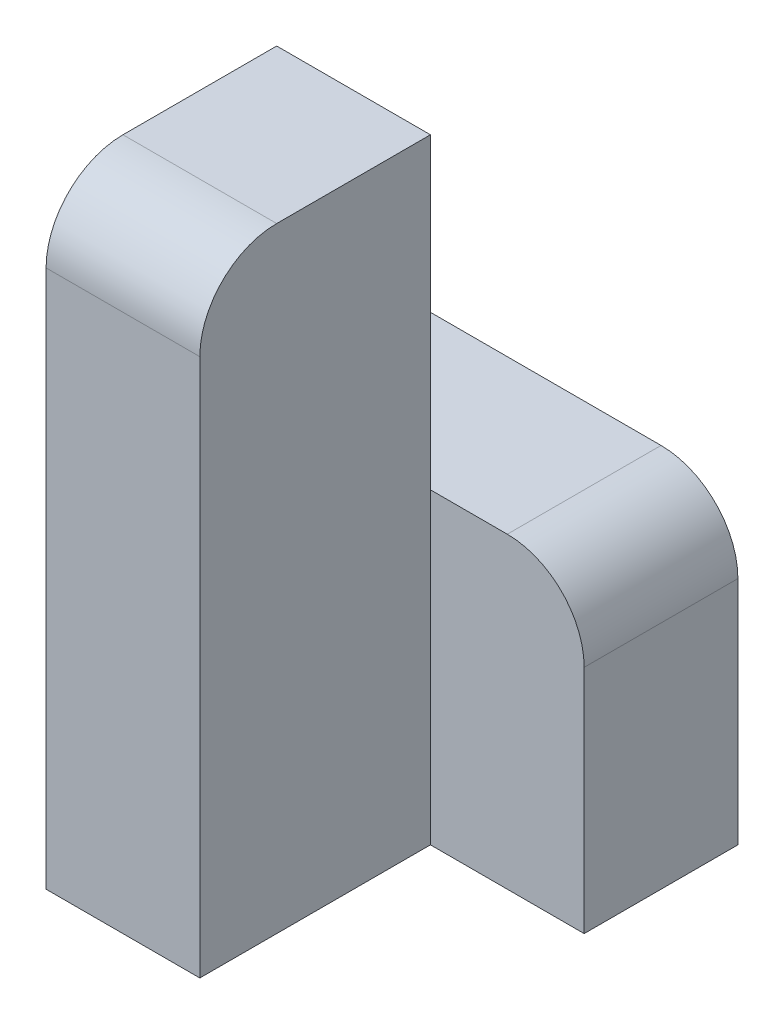
ISO-10303-21;
HEADER;
FILE_DESCRIPTION(('STEP AP214'),'2;1');
FILE_NAME('part.step','',(''),(''),'','','');
FILE_SCHEMA(('AUTOMOTIVE_DESIGN { 1 0 10303 214 1 1 1 1 }'));
ENDSEC;
DATA;
#1=APPLICATION_CONTEXT('core data for automotive mechanical design processes');
#2=APPLICATION_PROTOCOL_DEFINITION('international standard','automotive_design',2000,#1);
#3=PRODUCT_CONTEXT('',#1,'mechanical');
#4=PRODUCT('Part','Part','',(#3));
#5=PRODUCT_RELATED_PRODUCT_CATEGORY('part','',(#4));
#6=PRODUCT_DEFINITION_FORMATION('','',#4);
#7=PRODUCT_DEFINITION_CONTEXT('part definition',#1,'design');
#8=PRODUCT_DEFINITION('design','',#6,#7);
#9=PRODUCT_DEFINITION_SHAPE('','',#8);
#10=(LENGTH_UNIT() NAMED_UNIT(*) SI_UNIT(.MILLI.,.METRE.));
#11=(NAMED_UNIT(*) PLANE_ANGLE_UNIT() SI_UNIT($,.RADIAN.));
#12=(NAMED_UNIT(*) SI_UNIT($,.STERADIAN.) SOLID_ANGLE_UNIT());
#13=UNCERTAINTY_MEASURE_WITH_UNIT(LENGTH_MEASURE(1.E-05),#10,'distance_accuracy_value','');
#14=(GEOMETRIC_REPRESENTATION_CONTEXT(3) GLOBAL_UNCERTAINTY_ASSIGNED_CONTEXT((#13)) GLOBAL_UNIT_ASSIGNED_CONTEXT((#10,
#11,#12)) REPRESENTATION_CONTEXT('',''));
#15=CARTESIAN_POINT('',(0.,0.,0.));
#16=DIRECTION('',(0.,0.,1.));
#17=DIRECTION('',(1.,0.,0.));
#18=AXIS2_PLACEMENT_3D('',#15,#16,#17);
#19=CARTESIAN_POINT('',(-10.,0.,30.));
#20=DIRECTION('',(0.,-1.,0.));
#21=DIRECTION('',(1.,0.,0.));
#22=AXIS2_PLACEMENT_3D('',#19,#20,#21);
#23=PLANE('',#22);
#24=DIRECTION('',(0.,0.,-1.));
#25=VECTOR('',#24,1.);
#26=CARTESIAN_POINT('',(-30.,0.,30.));
#27=LINE('',#26,#25);
#28=CARTESIAN_POINT('',(-30.,0.,20.));
#29=VERTEX_POINT('',#28);
#30=CARTESIAN_POINT('',(-30.,0.,0.));
#31=VERTEX_POINT('',#30);
#32=EDGE_CURVE('E171',#29,#31,#27,.T.);
#33=ORIENTED_EDGE('',*,*,#32,.F.);
#34=DIRECTION('',(-1.,0.,0.));
#35=VECTOR('',#34,1.);
#36=CARTESIAN_POINT('',(-10.,0.,20.));
#37=LINE('',#36,#35);
#38=CARTESIAN_POINT('',(-10.,0.,20.));
#39=VERTEX_POINT('',#38);
#40=EDGE_CURVE('E43',#29,#39,#37,.F.);
#41=ORIENTED_EDGE('',*,*,#40,.T.);
#42=DIRECTION('',(0.,0.,-1.));
#43=VECTOR('',#42,1.);
#44=CARTESIAN_POINT('',(-10.,0.,30.));
#45=LINE('',#44,#43);
#46=CARTESIAN_POINT('',(-10.,0.,0.));
#47=VERTEX_POINT('',#46);
#48=EDGE_CURVE('E158',#39,#47,#45,.T.);
#49=ORIENTED_EDGE('',*,*,#48,.T.);
#50=DIRECTION('',(-1.,0.,0.));
#51=VECTOR('',#50,1.);
#52=CARTESIAN_POINT('',(-10.,0.,0.));
#53=LINE('',#52,#51);
#54=EDGE_CURVE('E148',#47,#31,#53,.T.);
#55=ORIENTED_EDGE('',*,*,#54,.T.);
#56=EDGE_LOOP('',(#33,#41,#49,#55));
#57=FACE_BOUND('',#56,.T.);
#58=ADVANCED_FACE('F35',(#57),#23,.F.);
#59=CARTESIAN_POINT('',(-30.,0.,30.));
#60=DIRECTION('',(1.,0.,0.));
#61=DIRECTION('',(0.,0.,-1.));
#62=AXIS2_PLACEMENT_3D('',#59,#60,#61);
#63=PLANE('',#62);
#64=DIRECTION('',(0.,-1.,0.));
#65=VECTOR('',#64,1.);
#66=CARTESIAN_POINT('',(-30.,0.,30.));
#67=LINE('',#66,#65);
#68=CARTESIAN_POINT('',(-30.,-10.,30.));
#69=VERTEX_POINT('',#68);
#70=CARTESIAN_POINT('',(-30.,-80.,30.));
#71=VERTEX_POINT('',#70);
#72=EDGE_CURVE('E150',#69,#71,#67,.T.);
#73=ORIENTED_EDGE('',*,*,#72,.F.);
#74=CARTESIAN_POINT('',(-30.,-10.,20.));
#75=DIRECTION('',(1.,0.,0.));
#76=DIRECTION('',(0.,0.,-1.));
#77=AXIS2_PLACEMENT_3D('',#74,#75,#76);
#78=CIRCLE('',#77,10.);
#79=EDGE_CURVE('E57',#69,#29,#78,.F.);
#80=ORIENTED_EDGE('',*,*,#79,.T.);
#81=ORIENTED_EDGE('',*,*,#32,.T.);
#82=DIRECTION('',(0.,-1.,0.));
#83=VECTOR('',#82,1.);
#84=CARTESIAN_POINT('',(-30.,0.,0.));
#85=LINE('',#84,#83);
#86=CARTESIAN_POINT('',(-30.,-40.,0.));
#87=VERTEX_POINT('',#86);
#88=EDGE_CURVE('E126',#31,#87,#85,.T.);
#89=ORIENTED_EDGE('',*,*,#88,.T.);
#90=DIRECTION('',(0.,0.,1.));
#91=VECTOR('',#90,1.);
#92=CARTESIAN_POINT('',(-30.,-40.,-20.));
#93=LINE('',#92,#91);
#94=CARTESIAN_POINT('',(-30.,-40.,-20.));
#95=VERTEX_POINT('',#94);
#96=EDGE_CURVE('E111',#95,#87,#93,.T.);
#97=ORIENTED_EDGE('',*,*,#96,.F.);
#98=DIRECTION('',(0.,-1.,0.));
#99=VECTOR('',#98,1.);
#100=CARTESIAN_POINT('',(-30.,-40.,-20.));
#101=LINE('',#100,#99);
#102=CARTESIAN_POINT('',(-30.,-80.,-20.));
#103=VERTEX_POINT('',#102);
#104=EDGE_CURVE('E118',#95,#103,#101,.T.);
#105=ORIENTED_EDGE('',*,*,#104,.T.);
#106=DIRECTION('',(0.,0.,-1.));
#107=VECTOR('',#106,1.);
#108=CARTESIAN_POINT('',(-30.,-80.,30.));
#109=LINE('',#108,#107);
#110=EDGE_CURVE('E169',#71,#103,#109,.T.);
#111=ORIENTED_EDGE('',*,*,#110,.F.);
#112=EDGE_LOOP('',(#73,#80,#81,#89,#97,#105,#111));
#113=FACE_BOUND('',#112,.T.);
#114=ADVANCED_FACE('F123',(#113),#63,.F.);
#115=CARTESIAN_POINT('',(-30.,-80.,30.));
#116=DIRECTION('',(0.,1.,0.));
#117=DIRECTION('',(0.,0.,1.));
#118=AXIS2_PLACEMENT_3D('',#115,#116,#117);
#119=PLANE('',#118);
#120=ORIENTED_EDGE('',*,*,#110,.T.);
#121=DIRECTION('',(1.,0.,0.));
#122=VECTOR('',#121,1.);
#123=CARTESIAN_POINT('',(-30.,-80.,-20.));
#124=LINE('',#123,#122);
#125=CARTESIAN_POINT('',(10.,-80.,-20.));
#126=VERTEX_POINT('',#125);
#127=EDGE_CURVE('E134',#103,#126,#124,.T.);
#128=ORIENTED_EDGE('',*,*,#127,.T.);
#129=DIRECTION('',(0.,0.,1.));
#130=VECTOR('',#129,1.);
#131=CARTESIAN_POINT('',(10.,-80.,-20.));
#132=LINE('',#131,#130);
#133=CARTESIAN_POINT('',(10.,-80.,0.));
#134=VERTEX_POINT('',#133);
#135=EDGE_CURVE('E127',#126,#134,#132,.T.);
#136=ORIENTED_EDGE('',*,*,#135,.T.);
#137=DIRECTION('',(1.,0.,0.));
#138=VECTOR('',#137,1.);
#139=CARTESIAN_POINT('',(-30.,-80.,0.));
#140=LINE('',#139,#138);
#141=CARTESIAN_POINT('',(-10.,-80.,0.));
#142=VERTEX_POINT('',#141);
#143=EDGE_CURVE('E142',#142,#134,#140,.T.);
#144=ORIENTED_EDGE('',*,*,#143,.F.);
#145=DIRECTION('',(0.,0.,-1.));
#146=VECTOR('',#145,1.);
#147=CARTESIAN_POINT('',(-10.,-80.,30.));
#148=LINE('',#147,#146);
#149=CARTESIAN_POINT('',(-10.,-80.,30.));
#150=VERTEX_POINT('',#149);
#151=EDGE_CURVE('E166',#150,#142,#148,.T.);
#152=ORIENTED_EDGE('',*,*,#151,.F.);
#153=DIRECTION('',(1.,0.,0.));
#154=VECTOR('',#153,1.);
#155=CARTESIAN_POINT('',(-30.,-80.,30.));
#156=LINE('',#155,#154);
#157=EDGE_CURVE('E152',#71,#150,#156,.T.);
#158=ORIENTED_EDGE('',*,*,#157,.F.);
#159=EDGE_LOOP('',(#120,#128,#136,#144,#152,#158));
#160=FACE_BOUND('',#159,.T.);
#161=ADVANCED_FACE('F193',(#160),#119,.F.);
#162=CARTESIAN_POINT('',(-10.,-80.,30.));
#163=DIRECTION('',(-1.,0.,0.));
#164=DIRECTION('',(0.,0.,1.));
#165=AXIS2_PLACEMENT_3D('',#162,#163,#164);
#166=PLANE('',#165);
#167=ORIENTED_EDGE('',*,*,#48,.F.);
#168=CARTESIAN_POINT('',(-10.,-10.,20.));
#169=DIRECTION('',(-1.,0.,0.));
#170=DIRECTION('',(0.,0.,1.));
#171=AXIS2_PLACEMENT_3D('',#168,#169,#170);
#172=CIRCLE('',#171,10.);
#173=CARTESIAN_POINT('',(-10.,-9.99999999999999,30.));
#174=VERTEX_POINT('',#173);
#175=EDGE_CURVE('E11',#39,#174,#172,.F.);
#176=ORIENTED_EDGE('',*,*,#175,.T.);
#177=DIRECTION('',(0.,1.,0.));
#178=VECTOR('',#177,1.);
#179=CARTESIAN_POINT('',(-10.,-80.,30.));
#180=LINE('',#179,#178);
#181=EDGE_CURVE('E155',#150,#174,#180,.T.);
#182=ORIENTED_EDGE('',*,*,#181,.F.);
#183=ORIENTED_EDGE('',*,*,#151,.T.);
#184=DIRECTION('',(0.,1.,0.));
#185=VECTOR('',#184,1.);
#186=CARTESIAN_POINT('',(-10.,-80.,0.));
#187=LINE('',#186,#185);
#188=CARTESIAN_POINT('',(-10.,-40.,0.));
#189=VERTEX_POINT('',#188);
#190=EDGE_CURVE('E153',#142,#189,#187,.T.);
#191=ORIENTED_EDGE('',*,*,#190,.T.);
#192=EDGE_CURVE('E162',#189,#47,#187,.T.);
#193=ORIENTED_EDGE('',*,*,#192,.T.);
#194=EDGE_LOOP('',(#167,#176,#182,#183,#191,#193));
#195=FACE_BOUND('',#194,.T.);
#196=ADVANCED_FACE('F196',(#195),#166,.F.);
#197=CARTESIAN_POINT('',(0.,0.,30.));
#198=DIRECTION('',(0.,0.,1.));
#199=DIRECTION('',(1.,0.,0.));
#200=AXIS2_PLACEMENT_3D('',#197,#198,#199);
#201=PLANE('',#200);
#202=ORIENTED_EDGE('',*,*,#181,.T.);
#203=DIRECTION('',(-1.,0.,0.));
#204=VECTOR('',#203,1.);
#205=CARTESIAN_POINT('',(-30.,-10.,30.));
#206=LINE('',#205,#204);
#207=EDGE_CURVE('E181',#174,#69,#206,.T.);
#208=ORIENTED_EDGE('',*,*,#207,.T.);
#209=ORIENTED_EDGE('',*,*,#72,.T.);
#210=ORIENTED_EDGE('',*,*,#157,.T.);
#211=EDGE_LOOP('',(#202,#208,#209,#210));
#212=FACE_BOUND('',#211,.T.);
#213=ADVANCED_FACE('F186',(#212),#201,.T.);
#214=CARTESIAN_POINT('',(0.,0.,0.));
#215=DIRECTION('',(0.,0.,1.));
#216=DIRECTION('',(1.,0.,0.));
#217=AXIS2_PLACEMENT_3D('',#214,#215,#216);
#218=PLANE('',#217);
#219=ORIENTED_EDGE('',*,*,#192,.F.);
#220=DIRECTION('',(-1.,0.,0.));
#221=VECTOR('',#220,1.);
#222=CARTESIAN_POINT('',(10.,-40.,0.));
#223=LINE('',#222,#221);
#224=EDGE_CURVE('E143',#189,#87,#223,.T.);
#225=ORIENTED_EDGE('',*,*,#224,.T.);
#226=ORIENTED_EDGE('',*,*,#88,.F.);
#227=ORIENTED_EDGE('',*,*,#54,.F.);
#228=EDGE_LOOP('',(#219,#225,#226,#227));
#229=FACE_BOUND('',#228,.T.);
#230=ADVANCED_FACE('F215',(#229),#218,.F.);
#231=CARTESIAN_POINT('',(0.,0.,0.));
#232=DIRECTION('',(0.,0.,1.));
#233=DIRECTION('',(1.,0.,0.));
#234=AXIS2_PLACEMENT_3D('',#231,#232,#233);
#235=PLANE('',#234);
#236=DIRECTION('',(0.,1.,0.));
#237=VECTOR('',#236,1.);
#238=CARTESIAN_POINT('',(10.,-80.,0.));
#239=LINE('',#238,#237);
#240=CARTESIAN_POINT('',(10.,-50.,0.));
#241=VERTEX_POINT('',#240);
#242=EDGE_CURVE('E119',#134,#241,#239,.T.);
#243=ORIENTED_EDGE('',*,*,#242,.T.);
#244=CARTESIAN_POINT('',(0.,-50.,0.));
#245=DIRECTION('',(0.,0.,1.));
#246=DIRECTION('',(1.,0.,0.));
#247=AXIS2_PLACEMENT_3D('',#244,#245,#246);
#248=CIRCLE('',#247,10.);
#249=CARTESIAN_POINT('',(0.,-40.,0.));
#250=VERTEX_POINT('',#249);
#251=EDGE_CURVE('E176',#241,#250,#248,.T.);
#252=ORIENTED_EDGE('',*,*,#251,.T.);
#253=EDGE_CURVE('E140',#250,#189,#223,.T.);
#254=ORIENTED_EDGE('',*,*,#253,.T.);
#255=ORIENTED_EDGE('',*,*,#190,.F.);
#256=ORIENTED_EDGE('',*,*,#143,.T.);
#257=EDGE_LOOP('',(#243,#252,#254,#255,#256));
#258=FACE_BOUND('',#257,.T.);
#259=ADVANCED_FACE('F218',(#258),#235,.T.);
#260=CARTESIAN_POINT('',(10.,-40.,-20.));
#261=DIRECTION('',(0.,1.,0.));
#262=DIRECTION('',(-1.,0.,0.));
#263=AXIS2_PLACEMENT_3D('',#260,#261,#262);
#264=PLANE('',#263);
#265=ORIENTED_EDGE('',*,*,#253,.F.);
#266=DIRECTION('',(0.,0.,1.));
#267=VECTOR('',#266,1.);
#268=CARTESIAN_POINT('',(0.,-40.,-20.));
#269=LINE('',#268,#267);
#270=CARTESIAN_POINT('',(0.,-40.,-20.));
#271=VERTEX_POINT('',#270);
#272=EDGE_CURVE('E114',#250,#271,#269,.F.);
#273=ORIENTED_EDGE('',*,*,#272,.T.);
#274=DIRECTION('',(-1.,0.,0.));
#275=VECTOR('',#274,1.);
#276=CARTESIAN_POINT('',(10.,-40.,-20.));
#277=LINE('',#276,#275);
#278=EDGE_CURVE('E106',#271,#95,#277,.T.);
#279=ORIENTED_EDGE('',*,*,#278,.T.);
#280=ORIENTED_EDGE('',*,*,#96,.T.);
#281=ORIENTED_EDGE('',*,*,#224,.F.);
#282=EDGE_LOOP('',(#265,#273,#279,#280,#281));
#283=FACE_BOUND('',#282,.T.);
#284=ADVANCED_FACE('F109',(#283),#264,.T.);
#285=CARTESIAN_POINT('',(10.,-80.,-20.));
#286=DIRECTION('',(1.,0.,0.));
#287=DIRECTION('',(0.,0.,-1.));
#288=AXIS2_PLACEMENT_3D('',#285,#286,#287);
#289=PLANE('',#288);
#290=DIRECTION('',(0.,1.,0.));
#291=VECTOR('',#290,1.);
#292=CARTESIAN_POINT('',(10.,-80.,-20.));
#293=LINE('',#292,#291);
#294=CARTESIAN_POINT('',(10.,-50.,-20.));
#295=VERTEX_POINT('',#294);
#296=EDGE_CURVE('E128',#126,#295,#293,.T.);
#297=ORIENTED_EDGE('',*,*,#296,.T.);
#298=DIRECTION('',(0.,0.,1.));
#299=VECTOR('',#298,1.);
#300=CARTESIAN_POINT('',(10.,-50.,-20.));
#301=LINE('',#300,#299);
#302=EDGE_CURVE('E173',#295,#241,#301,.T.);
#303=ORIENTED_EDGE('',*,*,#302,.T.);
#304=ORIENTED_EDGE('',*,*,#242,.F.);
#305=ORIENTED_EDGE('',*,*,#135,.F.);
#306=EDGE_LOOP('',(#297,#303,#304,#305));
#307=FACE_BOUND('',#306,.T.);
#308=ADVANCED_FACE('F224',(#307),#289,.T.);
#309=CARTESIAN_POINT('',(0.,0.,-20.));
#310=DIRECTION('',(0.,0.,1.));
#311=DIRECTION('',(1.,0.,0.));
#312=AXIS2_PLACEMENT_3D('',#309,#310,#311);
#313=PLANE('',#312);
#314=ORIENTED_EDGE('',*,*,#278,.F.);
#315=CARTESIAN_POINT('',(0.,-50.,-20.));
#316=DIRECTION('',(0.,0.,1.));
#317=DIRECTION('',(1.,0.,0.));
#318=AXIS2_PLACEMENT_3D('',#315,#316,#317);
#319=CIRCLE('',#318,10.);
#320=EDGE_CURVE('E179',#271,#295,#319,.F.);
#321=ORIENTED_EDGE('',*,*,#320,.T.);
#322=ORIENTED_EDGE('',*,*,#296,.F.);
#323=ORIENTED_EDGE('',*,*,#127,.F.);
#324=ORIENTED_EDGE('',*,*,#104,.F.);
#325=EDGE_LOOP('',(#314,#321,#322,#323,#324));
#326=FACE_BOUND('',#325,.T.);
#327=ADVANCED_FACE('F131',(#326),#313,.F.);
#328=CARTESIAN_POINT('',(0.,-50.,-20.));
#329=DIRECTION('',(0.,0.,1.));
#330=DIRECTION('',(1.,0.,0.));
#331=AXIS2_PLACEMENT_3D('',#328,#329,#330);
#332=CYLINDRICAL_SURFACE('',#331,10.);
#333=ORIENTED_EDGE('',*,*,#320,.F.);
#334=ORIENTED_EDGE('',*,*,#272,.F.);
#335=ORIENTED_EDGE('',*,*,#251,.F.);
#336=ORIENTED_EDGE('',*,*,#302,.F.);
#337=EDGE_LOOP('',(#333,#334,#335,#336));
#338=FACE_BOUND('',#337,.T.);
#339=ADVANCED_FACE('F199',(#338),#332,.T.);
#340=CARTESIAN_POINT('',(0.,-10.,20.));
#341=DIRECTION('',(1.,0.,0.));
#342=DIRECTION('',(0.,1.,0.));
#343=AXIS2_PLACEMENT_3D('',#340,#341,#342);
#344=CYLINDRICAL_SURFACE('',#343,10.);
#345=ORIENTED_EDGE('',*,*,#175,.F.);
#346=ORIENTED_EDGE('',*,*,#40,.F.);
#347=ORIENTED_EDGE('',*,*,#79,.F.);
#348=ORIENTED_EDGE('',*,*,#207,.F.);
#349=EDGE_LOOP('',(#345,#346,#347,#348));
#350=FACE_BOUND('',#349,.T.);
#351=ADVANCED_FACE('F37',(#350),#344,.T.);
#352=CLOSED_SHELL('',(#58,#114,#161,#196,#213,#230,#259,#284,#308,#327,#339,#351));
#353=MANIFOLD_SOLID_BREP('B2',#352);
#354=ADVANCED_BREP_SHAPE_REPRESENTATION('',(#18,#353),#14);
#355=SHAPE_DEFINITION_REPRESENTATION(#9,#354);
ENDSEC;
END-ISO-10303-21;
